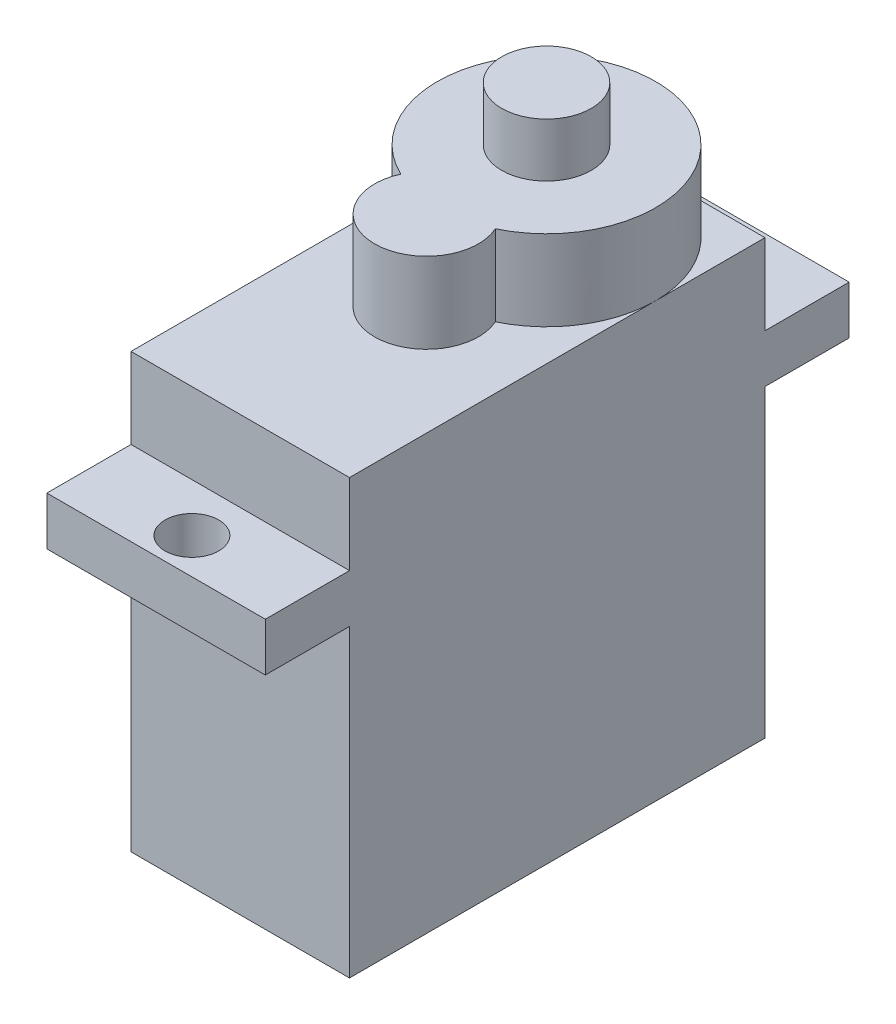
ISO-10303-21;
HEADER;
FILE_DESCRIPTION(('STEP AP214'),'2;1');
FILE_NAME('part.step','',(''),(''),'','','');
FILE_SCHEMA(('AUTOMOTIVE_DESIGN { 1 0 10303 214 1 1 1 1 }'));
ENDSEC;
DATA;
#1=APPLICATION_CONTEXT('core data for automotive mechanical design processes');
#2=APPLICATION_PROTOCOL_DEFINITION('international standard','automotive_design',2000,#1);
#3=PRODUCT_CONTEXT('',#1,'mechanical');
#4=PRODUCT('Part','Part','',(#3));
#5=PRODUCT_RELATED_PRODUCT_CATEGORY('part','',(#4));
#6=PRODUCT_DEFINITION_FORMATION('','',#4);
#7=PRODUCT_DEFINITION_CONTEXT('part definition',#1,'design');
#8=PRODUCT_DEFINITION('design','',#6,#7);
#9=PRODUCT_DEFINITION_SHAPE('','',#8);
#10=(LENGTH_UNIT() NAMED_UNIT(*) SI_UNIT(.MILLI.,.METRE.));
#11=(NAMED_UNIT(*) PLANE_ANGLE_UNIT() SI_UNIT($,.RADIAN.));
#12=(NAMED_UNIT(*) SI_UNIT($,.STERADIAN.) SOLID_ANGLE_UNIT());
#13=UNCERTAINTY_MEASURE_WITH_UNIT(LENGTH_MEASURE(1.E-05),#10,'distance_accuracy_value','');
#14=(GEOMETRIC_REPRESENTATION_CONTEXT(3) GLOBAL_UNCERTAINTY_ASSIGNED_CONTEXT((#13)) GLOBAL_UNIT_ASSIGNED_CONTEXT((#10,
#11,#12)) REPRESENTATION_CONTEXT('',''));
#15=CARTESIAN_POINT('',(0.,0.,0.));
#16=DIRECTION('',(0.,0.,1.));
#17=DIRECTION('',(1.,0.,0.));
#18=AXIS2_PLACEMENT_3D('',#15,#16,#17);
#19=CARTESIAN_POINT('',(0.,24.2,0.));
#20=DIRECTION('',(0.,-1.,0.));
#21=DIRECTION('',(0.,0.,-1.));
#22=AXIS2_PLACEMENT_3D('',#19,#20,#21);
#23=PLANE('',#22);
#24=CARTESIAN_POINT('',(0.,24.2,-5.5));
#25=DIRECTION('',(0.,1.,0.));
#26=DIRECTION('',(0.,0.,1.));
#27=AXIS2_PLACEMENT_3D('',#24,#25,#26);
#28=CIRCLE('',#27,6.1);
#29=CARTESIAN_POINT('',(2.63973642591585,24.2,-0.000746268656716051));
#30=VERTEX_POINT('',#29);
#31=CARTESIAN_POINT('',(6.09999999999999,24.2,-5.5));
#32=VERTEX_POINT('',#31);
#33=EDGE_CURVE('E282',#30,#32,#28,.T.);
#34=ORIENTED_EDGE('',*,*,#33,.F.);
#35=CARTESIAN_POINT('',(0.,24.2,1.2));
#36=DIRECTION('',(0.,1.,0.));
#37=DIRECTION('',(0.,0.,1.));
#38=AXIS2_PLACEMENT_3D('',#35,#36,#37);
#39=CIRCLE('',#38,2.9);
#40=CARTESIAN_POINT('',(-2.63973642591585,24.2,-0.000746268656716051));
#41=VERTEX_POINT('',#40);
#42=EDGE_CURVE('E62',#41,#30,#39,.T.);
#43=ORIENTED_EDGE('',*,*,#42,.F.);
#44=CARTESIAN_POINT('',(-6.1,24.2,-5.5));
#45=VERTEX_POINT('',#44);
#46=EDGE_CURVE('E66',#45,#41,#28,.T.);
#47=ORIENTED_EDGE('',*,*,#46,.F.);
#48=DIRECTION('',(0.,0.,1.));
#49=VECTOR('',#48,1.);
#50=CARTESIAN_POINT('',(-6.1,24.2,11.6));
#51=LINE('',#50,#49);
#52=CARTESIAN_POINT('',(-6.1,24.2,11.6));
#53=VERTEX_POINT('',#52);
#54=EDGE_CURVE('E247',#45,#53,#51,.T.);
#55=ORIENTED_EDGE('',*,*,#54,.T.);
#56=DIRECTION('',(1.,0.,0.));
#57=VECTOR('',#56,1.);
#58=CARTESIAN_POINT('',(-6.1,24.2,11.6));
#59=LINE('',#58,#57);
#60=CARTESIAN_POINT('',(6.09999999999999,24.2,11.6));
#61=VERTEX_POINT('',#60);
#62=EDGE_CURVE('E251',#53,#61,#59,.T.);
#63=ORIENTED_EDGE('',*,*,#62,.T.);
#64=DIRECTION('',(0.,0.,-1.));
#65=VECTOR('',#64,1.);
#66=CARTESIAN_POINT('',(6.09999999999999,24.2,11.6));
#67=LINE('',#66,#65);
#68=EDGE_CURVE('E239',#61,#32,#67,.T.);
#69=ORIENTED_EDGE('',*,*,#68,.T.);
#70=EDGE_LOOP('',(#34,#43,#47,#55,#63,#69));
#71=FACE_BOUND('',#70,.T.);
#72=ADVANCED_FACE('F45',(#71),#23,.F.);
#73=CARTESIAN_POINT('',(0.,24.2,-11.6));
#74=VERTEX_POINT('',#73);
#75=EDGE_CURVE('E54',#32,#74,#28,.T.);
#76=ORIENTED_EDGE('',*,*,#75,.F.);
#77=CARTESIAN_POINT('',(6.09999999999999,24.2,-11.6));
#78=VERTEX_POINT('',#77);
#79=EDGE_CURVE('E243',#32,#78,#67,.T.);
#80=ORIENTED_EDGE('',*,*,#79,.T.);
#81=DIRECTION('',(-1.,0.,0.));
#82=VECTOR('',#81,1.);
#83=CARTESIAN_POINT('',(-6.1,24.2,-11.6));
#84=LINE('',#83,#82);
#85=EDGE_CURVE('E244',#78,#74,#84,.T.);
#86=ORIENTED_EDGE('',*,*,#85,.T.);
#87=EDGE_LOOP('',(#76,#80,#86));
#88=FACE_BOUND('',#87,.T.);
#89=ADVANCED_FACE('F329',(#88),#23,.F.);
#90=CARTESIAN_POINT('',(-6.1,24.2,-11.6));
#91=DIRECTION('',(0.,0.,1.));
#92=DIRECTION('',(1.,0.,0.));
#93=AXIS2_PLACEMENT_3D('',#90,#91,#92);
#94=PLANE('',#93);
#95=DIRECTION('',(0.,-1.,0.));
#96=VECTOR('',#95,1.);
#97=CARTESIAN_POINT('',(6.09999999999999,24.2,-11.6));
#98=LINE('',#97,#96);
#99=CARTESIAN_POINT('',(6.09999999999999,19.7,-11.6));
#100=VERTEX_POINT('',#99);
#101=EDGE_CURVE('E275',#78,#100,#98,.T.);
#102=ORIENTED_EDGE('',*,*,#101,.T.);
#103=DIRECTION('',(-1.,0.,0.));
#104=VECTOR('',#103,1.);
#105=CARTESIAN_POINT('',(-6.09999999999999,19.7,-11.6));
#106=LINE('',#105,#104);
#107=CARTESIAN_POINT('',(-6.09999999999999,19.7,-11.6));
#108=VERTEX_POINT('',#107);
#109=EDGE_CURVE('E187',#100,#108,#106,.T.);
#110=ORIENTED_EDGE('',*,*,#109,.T.);
#111=DIRECTION('',(0.,-1.,0.));
#112=VECTOR('',#111,1.);
#113=CARTESIAN_POINT('',(-6.1,24.2,-11.6));
#114=LINE('',#113,#112);
#115=CARTESIAN_POINT('',(-6.1,24.2,-11.6));
#116=VERTEX_POINT('',#115);
#117=EDGE_CURVE('E272',#116,#108,#114,.T.);
#118=ORIENTED_EDGE('',*,*,#117,.F.);
#119=EDGE_CURVE('E242',#74,#116,#84,.T.);
#120=ORIENTED_EDGE('',*,*,#119,.F.);
#121=ORIENTED_EDGE('',*,*,#85,.F.);
#122=EDGE_LOOP('',(#102,#110,#118,#120,#121));
#123=FACE_BOUND('',#122,.T.);
#124=ADVANCED_FACE('F328',(#123),#94,.F.);
#125=CARTESIAN_POINT('',(-6.1,24.2,11.6));
#126=DIRECTION('',(0.,0.,-1.));
#127=DIRECTION('',(-1.,0.,0.));
#128=AXIS2_PLACEMENT_3D('',#125,#126,#127);
#129=PLANE('',#128);
#130=DIRECTION('',(1.,0.,0.));
#131=VECTOR('',#130,1.);
#132=CARTESIAN_POINT('',(-6.1,17.,11.6));
#133=LINE('',#132,#131);
#134=CARTESIAN_POINT('',(-6.1,17.,11.6));
#135=VERTEX_POINT('',#134);
#136=CARTESIAN_POINT('',(6.09999999999999,17.,11.6));
#137=VERTEX_POINT('',#136);
#138=EDGE_CURVE('E215',#135,#137,#133,.T.);
#139=ORIENTED_EDGE('',*,*,#138,.F.);
#140=DIRECTION('',(0.,-1.,0.));
#141=VECTOR('',#140,1.);
#142=CARTESIAN_POINT('',(-6.1,24.2,11.6));
#143=LINE('',#142,#141);
#144=CARTESIAN_POINT('',(-6.1,0.,11.6));
#145=VERTEX_POINT('',#144);
#146=EDGE_CURVE('E268',#135,#145,#143,.T.);
#147=ORIENTED_EDGE('',*,*,#146,.T.);
#148=DIRECTION('',(1.,0.,0.));
#149=VECTOR('',#148,1.);
#150=CARTESIAN_POINT('',(-6.1,0.,11.6));
#151=LINE('',#150,#149);
#152=CARTESIAN_POINT('',(6.09999999999999,0.,11.6));
#153=VERTEX_POINT('',#152);
#154=EDGE_CURVE('E262',#145,#153,#151,.T.);
#155=ORIENTED_EDGE('',*,*,#154,.T.);
#156=DIRECTION('',(0.,-1.,0.));
#157=VECTOR('',#156,1.);
#158=CARTESIAN_POINT('',(6.09999999999999,24.2,11.6));
#159=LINE('',#158,#157);
#160=EDGE_CURVE('E253',#137,#153,#159,.T.);
#161=ORIENTED_EDGE('',*,*,#160,.F.);
#162=EDGE_LOOP('',(#139,#147,#155,#161));
#163=FACE_BOUND('',#162,.T.);
#164=ADVANCED_FACE('F298',(#163),#129,.F.);
#165=DIRECTION('',(-1.,0.,0.));
#166=VECTOR('',#165,1.);
#167=CARTESIAN_POINT('',(-6.09999999999999,19.7,11.6));
#168=LINE('',#167,#166);
#169=CARTESIAN_POINT('',(6.09999999999999,19.7,11.6));
#170=VERTEX_POINT('',#169);
#171=CARTESIAN_POINT('',(-6.09999999999999,19.7,11.6));
#172=VERTEX_POINT('',#171);
#173=EDGE_CURVE('E222',#170,#172,#168,.T.);
#174=ORIENTED_EDGE('',*,*,#173,.F.);
#175=EDGE_CURVE('E265',#61,#170,#159,.T.);
#176=ORIENTED_EDGE('',*,*,#175,.F.);
#177=ORIENTED_EDGE('',*,*,#62,.F.);
#178=EDGE_CURVE('E269',#53,#172,#143,.T.);
#179=ORIENTED_EDGE('',*,*,#178,.T.);
#180=EDGE_LOOP('',(#174,#176,#177,#179));
#181=FACE_BOUND('',#180,.T.);
#182=ADVANCED_FACE('F352',(#181),#129,.F.);
#183=CARTESIAN_POINT('',(6.09999999999999,24.2,11.6));
#184=DIRECTION('',(-1.,0.,0.));
#185=DIRECTION('',(0.,0.,1.));
#186=AXIS2_PLACEMENT_3D('',#183,#184,#185);
#187=PLANE('',#186);
#188=DIRECTION('',(0.,0.,-1.));
#189=VECTOR('',#188,1.);
#190=CARTESIAN_POINT('',(6.09999999999999,0.,11.6));
#191=LINE('',#190,#189);
#192=CARTESIAN_POINT('',(6.09999999999999,0.,-11.6));
#193=VERTEX_POINT('',#192);
#194=EDGE_CURVE('E238',#153,#193,#191,.T.);
#195=ORIENTED_EDGE('',*,*,#194,.T.);
#196=CARTESIAN_POINT('',(6.09999999999999,17.,-11.6));
#197=VERTEX_POINT('',#196);
#198=EDGE_CURVE('E274',#197,#193,#98,.T.);
#199=ORIENTED_EDGE('',*,*,#198,.F.);
#200=DIRECTION('',(0.,0.,1.));
#201=VECTOR('',#200,1.);
#202=CARTESIAN_POINT('',(6.1,17.,-16.3));
#203=LINE('',#202,#201);
#204=CARTESIAN_POINT('',(6.1,17.,-16.3));
#205=VERTEX_POINT('',#204);
#206=EDGE_CURVE('E206',#205,#197,#203,.T.);
#207=ORIENTED_EDGE('',*,*,#206,.F.);
#208=DIRECTION('',(0.,1.,0.));
#209=VECTOR('',#208,1.);
#210=CARTESIAN_POINT('',(6.1,17.,-16.3));
#211=LINE('',#210,#209);
#212=CARTESIAN_POINT('',(6.09999999999999,19.7,-16.3));
#213=VERTEX_POINT('',#212);
#214=EDGE_CURVE('E183',#205,#213,#211,.T.);
#215=ORIENTED_EDGE('',*,*,#214,.T.);
#216=DIRECTION('',(0.,0.,1.));
#217=VECTOR('',#216,1.);
#218=CARTESIAN_POINT('',(6.09999999999999,19.7,-16.3));
#219=LINE('',#218,#217);
#220=EDGE_CURVE('E196',#213,#100,#219,.T.);
#221=ORIENTED_EDGE('',*,*,#220,.T.);
#222=ORIENTED_EDGE('',*,*,#101,.F.);
#223=ORIENTED_EDGE('',*,*,#79,.F.);
#224=ORIENTED_EDGE('',*,*,#68,.F.);
#225=ORIENTED_EDGE('',*,*,#175,.T.);
#226=DIRECTION('',(0.,0.,-1.));
#227=VECTOR('',#226,1.);
#228=CARTESIAN_POINT('',(6.09999999999999,19.7,16.3));
#229=LINE('',#228,#227);
#230=CARTESIAN_POINT('',(6.09999999999999,19.7,16.3));
#231=VERTEX_POINT('',#230);
#232=EDGE_CURVE('E235',#231,#170,#229,.T.);
#233=ORIENTED_EDGE('',*,*,#232,.F.);
#234=DIRECTION('',(0.,1.,0.));
#235=VECTOR('',#234,1.);
#236=CARTESIAN_POINT('',(6.1,17.,16.3));
#237=LINE('',#236,#235);
#238=CARTESIAN_POINT('',(6.1,17.,16.3));
#239=VERTEX_POINT('',#238);
#240=EDGE_CURVE('E211',#239,#231,#237,.T.);
#241=ORIENTED_EDGE('',*,*,#240,.F.);
#242=DIRECTION('',(0.,0.,-1.));
#243=VECTOR('',#242,1.);
#244=CARTESIAN_POINT('',(6.1,17.,16.3));
#245=LINE('',#244,#243);
#246=EDGE_CURVE('E221',#239,#137,#245,.T.);
#247=ORIENTED_EDGE('',*,*,#246,.T.);
#248=ORIENTED_EDGE('',*,*,#160,.T.);
#249=EDGE_LOOP('',(#195,#199,#207,#215,#221,#222,#223,#224,#225,#233,#241,#247,#248));
#250=FACE_BOUND('',#249,.T.);
#251=ADVANCED_FACE('F47',(#250),#187,.F.);
#252=CARTESIAN_POINT('',(-6.1,17.,-11.6));
#253=VERTEX_POINT('',#252);
#254=CARTESIAN_POINT('',(-6.1,0.,-11.6));
#255=VERTEX_POINT('',#254);
#256=EDGE_CURVE('E271',#253,#255,#114,.T.);
#257=ORIENTED_EDGE('',*,*,#256,.F.);
#258=DIRECTION('',(1.,0.,0.));
#259=VECTOR('',#258,1.);
#260=CARTESIAN_POINT('',(-6.1,17.,-11.6));
#261=LINE('',#260,#259);
#262=EDGE_CURVE('E182',#253,#197,#261,.T.);
#263=ORIENTED_EDGE('',*,*,#262,.T.);
#264=ORIENTED_EDGE('',*,*,#198,.T.);
#265=DIRECTION('',(-1.,0.,0.));
#266=VECTOR('',#265,1.);
#267=CARTESIAN_POINT('',(-6.1,0.,-11.6));
#268=LINE('',#267,#266);
#269=EDGE_CURVE('E256',#193,#255,#268,.T.);
#270=ORIENTED_EDGE('',*,*,#269,.T.);
#271=EDGE_LOOP('',(#257,#263,#264,#270));
#272=FACE_BOUND('',#271,.T.);
#273=ADVANCED_FACE('F287',(#272),#94,.F.);
#274=CARTESIAN_POINT('',(-6.1,24.2,11.6));
#275=DIRECTION('',(1.,0.,0.));
#276=DIRECTION('',(0.,0.,-1.));
#277=AXIS2_PLACEMENT_3D('',#274,#275,#276);
#278=PLANE('',#277);
#279=DIRECTION('',(0.,0.,1.));
#280=VECTOR('',#279,1.);
#281=CARTESIAN_POINT('',(-6.1,0.,11.6));
#282=LINE('',#281,#280);
#283=EDGE_CURVE('E259',#255,#145,#282,.T.);
#284=ORIENTED_EDGE('',*,*,#283,.T.);
#285=ORIENTED_EDGE('',*,*,#146,.F.);
#286=DIRECTION('',(0.,0.,-1.));
#287=VECTOR('',#286,1.);
#288=CARTESIAN_POINT('',(-6.1,17.,16.3));
#289=LINE('',#288,#287);
#290=CARTESIAN_POINT('',(-6.1,17.,16.3));
#291=VERTEX_POINT('',#290);
#292=EDGE_CURVE('E229',#291,#135,#289,.T.);
#293=ORIENTED_EDGE('',*,*,#292,.F.);
#294=DIRECTION('',(0.,-1.,0.));
#295=VECTOR('',#294,1.);
#296=CARTESIAN_POINT('',(-6.09999999999999,19.7,16.3));
#297=LINE('',#296,#295);
#298=CARTESIAN_POINT('',(-6.09999999999999,19.7,16.3));
#299=VERTEX_POINT('',#298);
#300=EDGE_CURVE('E217',#299,#291,#297,.T.);
#301=ORIENTED_EDGE('',*,*,#300,.F.);
#302=DIRECTION('',(0.,0.,-1.));
#303=VECTOR('',#302,1.);
#304=CARTESIAN_POINT('',(-6.09999999999999,19.7,16.3));
#305=LINE('',#304,#303);
#306=EDGE_CURVE('E232',#299,#172,#305,.T.);
#307=ORIENTED_EDGE('',*,*,#306,.T.);
#308=ORIENTED_EDGE('',*,*,#178,.F.);
#309=ORIENTED_EDGE('',*,*,#54,.F.);
#310=EDGE_CURVE('E248',#116,#45,#51,.T.);
#311=ORIENTED_EDGE('',*,*,#310,.F.);
#312=ORIENTED_EDGE('',*,*,#117,.T.);
#313=DIRECTION('',(0.,0.,1.));
#314=VECTOR('',#313,1.);
#315=CARTESIAN_POINT('',(-6.09999999999999,19.7,-16.3));
#316=LINE('',#315,#314);
#317=CARTESIAN_POINT('',(-6.09999999999999,19.7,-16.3));
#318=VERTEX_POINT('',#317);
#319=EDGE_CURVE('E202',#318,#108,#316,.T.);
#320=ORIENTED_EDGE('',*,*,#319,.F.);
#321=DIRECTION('',(0.,-1.,0.));
#322=VECTOR('',#321,1.);
#323=CARTESIAN_POINT('',(-6.09999999999999,19.7,-16.3));
#324=LINE('',#323,#322);
#325=CARTESIAN_POINT('',(-6.1,17.,-16.3));
#326=VERTEX_POINT('',#325);
#327=EDGE_CURVE('E190',#318,#326,#324,.T.);
#328=ORIENTED_EDGE('',*,*,#327,.T.);
#329=DIRECTION('',(0.,0.,1.));
#330=VECTOR('',#329,1.);
#331=CARTESIAN_POINT('',(-6.1,17.,-16.3));
#332=LINE('',#331,#330);
#333=EDGE_CURVE('E204',#326,#253,#332,.T.);
#334=ORIENTED_EDGE('',*,*,#333,.T.);
#335=ORIENTED_EDGE('',*,*,#256,.T.);
#336=EDGE_LOOP('',(#284,#285,#293,#301,#307,#308,#309,#311,#312,#320,#328,#334,#335));
#337=FACE_BOUND('',#336,.T.);
#338=ADVANCED_FACE('F302',(#337),#278,.F.);
#339=EDGE_CURVE('E280',#74,#45,#28,.T.);
#340=ORIENTED_EDGE('',*,*,#339,.F.);
#341=ORIENTED_EDGE('',*,*,#119,.T.);
#342=ORIENTED_EDGE('',*,*,#310,.T.);
#343=EDGE_LOOP('',(#340,#341,#342));
#344=FACE_BOUND('',#343,.T.);
#345=ADVANCED_FACE('F325',(#344),#23,.F.);
#346=CARTESIAN_POINT('',(0.,0.,0.));
#347=DIRECTION('',(0.,-1.,0.));
#348=DIRECTION('',(0.,0.,-1.));
#349=AXIS2_PLACEMENT_3D('',#346,#347,#348);
#350=PLANE('',#349);
#351=ORIENTED_EDGE('',*,*,#194,.F.);
#352=ORIENTED_EDGE('',*,*,#154,.F.);
#353=ORIENTED_EDGE('',*,*,#283,.F.);
#354=ORIENTED_EDGE('',*,*,#269,.F.);
#355=EDGE_LOOP('',(#351,#352,#353,#354));
#356=FACE_BOUND('',#355,.T.);
#357=ADVANCED_FACE('F293',(#356),#350,.T.);
#358=CARTESIAN_POINT('',(-6.09999999999999,19.7,16.3));
#359=DIRECTION('',(0.,-1.,0.));
#360=DIRECTION('',(0.,0.,-1.));
#361=AXIS2_PLACEMENT_3D('',#358,#359,#360);
#362=PLANE('',#361);
#363=CARTESIAN_POINT('',(0.,19.7,14.3));
#364=DIRECTION('',(0.,1.,0.));
#365=DIRECTION('',(0.,0.,1.));
#366=AXIS2_PLACEMENT_3D('',#363,#364,#365);
#367=CIRCLE('',#366,1.5);
#368=CARTESIAN_POINT('',(0.,19.7,15.8));
#369=VERTEX_POINT('',#368);
#370=EDGE_CURVE('E208',#369,#369,#367,.T.);
#371=ORIENTED_EDGE('',*,*,#370,.F.);
#372=EDGE_LOOP('',(#371));
#373=FACE_BOUND('',#372,.T.);
#374=ORIENTED_EDGE('',*,*,#173,.T.);
#375=ORIENTED_EDGE('',*,*,#306,.F.);
#376=DIRECTION('',(-1.,0.,0.));
#377=VECTOR('',#376,1.);
#378=CARTESIAN_POINT('',(-6.09999999999999,19.7,16.3));
#379=LINE('',#378,#377);
#380=EDGE_CURVE('E214',#231,#299,#379,.T.);
#381=ORIENTED_EDGE('',*,*,#380,.F.);
#382=ORIENTED_EDGE('',*,*,#232,.T.);
#383=EDGE_LOOP('',(#374,#375,#381,#382));
#384=FACE_BOUND('',#383,.T.);
#385=ADVANCED_FACE('F344',(#373,#384),#362,.F.);
#386=CARTESIAN_POINT('',(-6.1,17.,16.3));
#387=DIRECTION('',(0.,1.,0.));
#388=DIRECTION('',(0.,0.,1.));
#389=AXIS2_PLACEMENT_3D('',#386,#387,#388);
#390=PLANE('',#389);
#391=CARTESIAN_POINT('',(0.,17.,14.3));
#392=DIRECTION('',(0.,1.,0.));
#393=DIRECTION('',(0.,0.,1.));
#394=AXIS2_PLACEMENT_3D('',#391,#392,#393);
#395=CIRCLE('',#394,1.5);
#396=CARTESIAN_POINT('',(0.,17.,15.8));
#397=VERTEX_POINT('',#396);
#398=EDGE_CURVE('E49',#397,#397,#395,.T.);
#399=ORIENTED_EDGE('',*,*,#398,.T.);
#400=EDGE_LOOP('',(#399));
#401=FACE_BOUND('',#400,.T.);
#402=ORIENTED_EDGE('',*,*,#138,.T.);
#403=ORIENTED_EDGE('',*,*,#246,.F.);
#404=DIRECTION('',(1.,0.,0.));
#405=VECTOR('',#404,1.);
#406=CARTESIAN_POINT('',(-6.1,17.,16.3));
#407=LINE('',#406,#405);
#408=EDGE_CURVE('E219',#291,#239,#407,.T.);
#409=ORIENTED_EDGE('',*,*,#408,.F.);
#410=ORIENTED_EDGE('',*,*,#292,.T.);
#411=EDGE_LOOP('',(#402,#403,#409,#410));
#412=FACE_BOUND('',#411,.T.);
#413=ADVANCED_FACE('F369',(#401,#412),#390,.F.);
#414=CARTESIAN_POINT('',(0.,0.,16.3));
#415=DIRECTION('',(0.,0.,-1.));
#416=DIRECTION('',(-1.,0.,0.));
#417=AXIS2_PLACEMENT_3D('',#414,#415,#416);
#418=PLANE('',#417);
#419=ORIENTED_EDGE('',*,*,#240,.T.);
#420=ORIENTED_EDGE('',*,*,#380,.T.);
#421=ORIENTED_EDGE('',*,*,#300,.T.);
#422=ORIENTED_EDGE('',*,*,#408,.T.);
#423=EDGE_LOOP('',(#419,#420,#421,#422));
#424=FACE_BOUND('',#423,.T.);
#425=ADVANCED_FACE('F366',(#424),#418,.F.);
#426=CARTESIAN_POINT('',(0.,0.,14.3));
#427=DIRECTION('',(0.,1.,0.));
#428=DIRECTION('',(0.,0.,1.));
#429=AXIS2_PLACEMENT_3D('',#426,#427,#428);
#430=CYLINDRICAL_SURFACE('',#429,1.5);
#431=ORIENTED_EDGE('',*,*,#370,.T.);
#432=EDGE_LOOP('',(#431));
#433=FACE_BOUND('',#432,.T.);
#434=ORIENTED_EDGE('',*,*,#398,.F.);
#435=EDGE_LOOP('',(#434));
#436=FACE_BOUND('',#435,.T.);
#437=ADVANCED_FACE('F377',(#433,#436),#430,.F.);
#438=CARTESIAN_POINT('',(-6.1,17.,-16.3));
#439=DIRECTION('',(0.,-1.,0.));
#440=DIRECTION('',(0.,0.,-1.));
#441=AXIS2_PLACEMENT_3D('',#438,#439,#440);
#442=PLANE('',#441);
#443=CARTESIAN_POINT('',(0.,17.,-14.3));
#444=DIRECTION('',(0.,-1.,0.));
#445=DIRECTION('',(0.,0.,-1.));
#446=AXIS2_PLACEMENT_3D('',#443,#444,#445);
#447=CIRCLE('',#446,1.5);
#448=CARTESIAN_POINT('',(0.,17.,-15.8));
#449=VERTEX_POINT('',#448);
#450=EDGE_CURVE('E175',#449,#449,#447,.F.);
#451=ORIENTED_EDGE('',*,*,#450,.T.);
#452=EDGE_LOOP('',(#451));
#453=FACE_BOUND('',#452,.T.);
#454=ORIENTED_EDGE('',*,*,#262,.F.);
#455=ORIENTED_EDGE('',*,*,#333,.F.);
#456=DIRECTION('',(1.,0.,0.));
#457=VECTOR('',#456,1.);
#458=CARTESIAN_POINT('',(-6.1,17.,-16.3));
#459=LINE('',#458,#457);
#460=EDGE_CURVE('E186',#326,#205,#459,.T.);
#461=ORIENTED_EDGE('',*,*,#460,.T.);
#462=ORIENTED_EDGE('',*,*,#206,.T.);
#463=EDGE_LOOP('',(#454,#455,#461,#462));
#464=FACE_BOUND('',#463,.T.);
#465=ADVANCED_FACE('F306',(#453,#464),#442,.T.);
#466=CARTESIAN_POINT('',(-6.09999999999999,19.7,-16.3));
#467=DIRECTION('',(0.,1.,0.));
#468=DIRECTION('',(0.,0.,1.));
#469=AXIS2_PLACEMENT_3D('',#466,#467,#468);
#470=PLANE('',#469);
#471=CARTESIAN_POINT('',(0.,19.7,-14.3));
#472=DIRECTION('',(0.,-1.,0.));
#473=DIRECTION('',(0.,0.,-1.));
#474=AXIS2_PLACEMENT_3D('',#471,#472,#473);
#475=CIRCLE('',#474,1.5);
#476=CARTESIAN_POINT('',(0.,19.7,-15.8));
#477=VERTEX_POINT('',#476);
#478=EDGE_CURVE('E172',#477,#477,#475,.T.);
#479=ORIENTED_EDGE('',*,*,#478,.T.);
#480=EDGE_LOOP('',(#479));
#481=FACE_BOUND('',#480,.T.);
#482=ORIENTED_EDGE('',*,*,#109,.F.);
#483=ORIENTED_EDGE('',*,*,#220,.F.);
#484=DIRECTION('',(-1.,0.,0.));
#485=VECTOR('',#484,1.);
#486=CARTESIAN_POINT('',(-6.09999999999999,19.7,-16.3));
#487=LINE('',#486,#485);
#488=EDGE_CURVE('E193',#213,#318,#487,.T.);
#489=ORIENTED_EDGE('',*,*,#488,.T.);
#490=ORIENTED_EDGE('',*,*,#319,.T.);
#491=EDGE_LOOP('',(#482,#483,#489,#490));
#492=FACE_BOUND('',#491,.T.);
#493=ADVANCED_FACE('F313',(#481,#492),#470,.T.);
#494=CARTESIAN_POINT('',(0.,0.,-16.3));
#495=DIRECTION('',(0.,0.,1.));
#496=DIRECTION('',(-1.,0.,0.));
#497=AXIS2_PLACEMENT_3D('',#494,#495,#496);
#498=PLANE('',#497);
#499=ORIENTED_EDGE('',*,*,#214,.F.);
#500=ORIENTED_EDGE('',*,*,#460,.F.);
#501=ORIENTED_EDGE('',*,*,#327,.F.);
#502=ORIENTED_EDGE('',*,*,#488,.F.);
#503=EDGE_LOOP('',(#499,#500,#501,#502));
#504=FACE_BOUND('',#503,.T.);
#505=ADVANCED_FACE('F310',(#504),#498,.F.);
#506=CARTESIAN_POINT('',(0.,0.,-14.3));
#507=DIRECTION('',(0.,1.,0.));
#508=DIRECTION('',(0.,0.,1.));
#509=AXIS2_PLACEMENT_3D('',#506,#507,#508);
#510=CYLINDRICAL_SURFACE('',#509,1.5);
#511=ORIENTED_EDGE('',*,*,#450,.F.);
#512=EDGE_LOOP('',(#511));
#513=FACE_BOUND('',#512,.T.);
#514=ORIENTED_EDGE('',*,*,#478,.F.);
#515=EDGE_LOOP('',(#514));
#516=FACE_BOUND('',#515,.T.);
#517=ADVANCED_FACE('F392',(#513,#516),#510,.F.);
#518=CARTESIAN_POINT('',(0.,28.7,-5.5));
#519=DIRECTION('',(0.,-1.,0.));
#520=DIRECTION('',(0.,0.,-1.));
#521=AXIS2_PLACEMENT_3D('',#518,#519,#520);
#522=CYLINDRICAL_SURFACE('',#521,6.1);
#523=ORIENTED_EDGE('',*,*,#33,.T.);
#524=ORIENTED_EDGE('',*,*,#75,.T.);
#525=ORIENTED_EDGE('',*,*,#339,.T.);
#526=ORIENTED_EDGE('',*,*,#46,.T.);
#527=DIRECTION('',(0.,-1.,0.));
#528=VECTOR('',#527,1.);
#529=CARTESIAN_POINT('',(-2.63973642591585,28.7,-0.000746268656716051));
#530=LINE('',#529,#528);
#531=CARTESIAN_POINT('',(-2.63973642591585,28.7,-0.000746268656716051));
#532=VERTEX_POINT('',#531);
#533=EDGE_CURVE('E159',#532,#41,#530,.T.);
#534=ORIENTED_EDGE('',*,*,#533,.F.);
#535=CARTESIAN_POINT('',(0.,28.7,-5.5));
#536=DIRECTION('',(0.,1.,0.));
#537=DIRECTION('',(0.,0.,1.));
#538=AXIS2_PLACEMENT_3D('',#535,#536,#537);
#539=CIRCLE('',#538,6.1);
#540=CARTESIAN_POINT('',(2.63973642591585,28.7,-0.000746268656716051));
#541=VERTEX_POINT('',#540);
#542=EDGE_CURVE('E164',#541,#532,#539,.T.);
#543=ORIENTED_EDGE('',*,*,#542,.F.);
#544=DIRECTION('',(0.,-1.,0.));
#545=VECTOR('',#544,1.);
#546=CARTESIAN_POINT('',(2.63973642591585,28.7,-0.000746268656716051));
#547=LINE('',#546,#545);
#548=EDGE_CURVE('E161',#541,#30,#547,.T.);
#549=ORIENTED_EDGE('',*,*,#548,.T.);
#550=EDGE_LOOP('',(#523,#524,#525,#526,#534,#543,#549));
#551=FACE_BOUND('',#550,.T.);
#552=ADVANCED_FACE('F170',(#551),#522,.T.);
#553=CARTESIAN_POINT('',(0.,28.7,1.2));
#554=DIRECTION('',(0.,-1.,0.));
#555=DIRECTION('',(0.,0.,-1.));
#556=AXIS2_PLACEMENT_3D('',#553,#554,#555);
#557=CYLINDRICAL_SURFACE('',#556,2.9);
#558=ORIENTED_EDGE('',*,*,#42,.T.);
#559=ORIENTED_EDGE('',*,*,#548,.F.);
#560=CARTESIAN_POINT('',(0.,28.7,1.2));
#561=DIRECTION('',(0.,1.,0.));
#562=DIRECTION('',(0.,0.,1.));
#563=AXIS2_PLACEMENT_3D('',#560,#561,#562);
#564=CIRCLE('',#563,2.9);
#565=EDGE_CURVE('E155',#532,#541,#564,.T.);
#566=ORIENTED_EDGE('',*,*,#565,.F.);
#567=ORIENTED_EDGE('',*,*,#533,.T.);
#568=EDGE_LOOP('',(#558,#559,#566,#567));
#569=FACE_BOUND('',#568,.T.);
#570=ADVANCED_FACE('F157',(#569),#557,.T.);
#571=CARTESIAN_POINT('',(0.,28.7,0.));
#572=DIRECTION('',(0.,1.,0.));
#573=DIRECTION('',(0.,0.,1.));
#574=AXIS2_PLACEMENT_3D('',#571,#572,#573);
#575=PLANE('',#574);
#576=CARTESIAN_POINT('',(0.,28.7,-5.5));
#577=DIRECTION('',(0.,1.,0.));
#578=DIRECTION('',(0.,0.,1.));
#579=AXIS2_PLACEMENT_3D('',#576,#577,#578);
#580=CIRCLE('',#579,2.5);
#581=CARTESIAN_POINT('',(0.,28.7,-3.));
#582=VERTEX_POINT('',#581);
#583=EDGE_CURVE('E11',#582,#582,#580,.T.);
#584=ORIENTED_EDGE('',*,*,#583,.F.);
#585=EDGE_LOOP('',(#584));
#586=FACE_BOUND('',#585,.T.);
#587=ORIENTED_EDGE('',*,*,#542,.T.);
#588=ORIENTED_EDGE('',*,*,#565,.T.);
#589=EDGE_LOOP('',(#587,#588));
#590=FACE_BOUND('',#589,.T.);
#591=ADVANCED_FACE('F166',(#586,#590),#575,.T.);
#592=CARTESIAN_POINT('',(0.,31.7,-5.5));
#593=DIRECTION('',(0.,-1.,0.));
#594=DIRECTION('',(0.,0.,-1.));
#595=AXIS2_PLACEMENT_3D('',#592,#593,#594);
#596=CYLINDRICAL_SURFACE('',#595,2.5);
#597=CARTESIAN_POINT('',(0.,31.7,-5.5));
#598=DIRECTION('',(0.,1.,0.));
#599=DIRECTION('',(0.,0.,1.));
#600=AXIS2_PLACEMENT_3D('',#597,#598,#599);
#601=CIRCLE('',#600,2.5);
#602=CARTESIAN_POINT('',(0.,31.7,-3.));
#603=VERTEX_POINT('',#602);
#604=EDGE_CURVE('E320',#603,#603,#601,.T.);
#605=ORIENTED_EDGE('',*,*,#604,.F.);
#606=EDGE_LOOP('',(#605));
#607=FACE_BOUND('',#606,.T.);
#608=ORIENTED_EDGE('',*,*,#583,.T.);
#609=EDGE_LOOP('',(#608));
#610=FACE_BOUND('',#609,.T.);
#611=ADVANCED_FACE('F401',(#607,#610),#596,.T.);
#612=CARTESIAN_POINT('',(0.,31.7,-5.5));
#613=DIRECTION('',(0.,1.,0.));
#614=DIRECTION('',(0.,0.,1.));
#615=AXIS2_PLACEMENT_3D('',#612,#613,#614);
#616=PLANE('',#615);
#617=ORIENTED_EDGE('',*,*,#604,.T.);
#618=EDGE_LOOP('',(#617));
#619=FACE_BOUND('',#618,.T.);
#620=ADVANCED_FACE('F405',(#619),#616,.T.);
#621=CLOSED_SHELL('',(#72,#89,#124,#164,#182,#251,#273,#338,#345,#357,#385,#413,#425,#437,#465,
#493,#505,#517,#552,#570,#591,#611,#620));
#622=MANIFOLD_SOLID_BREP('B2',#621);
#623=ADVANCED_BREP_SHAPE_REPRESENTATION('',(#18,#622),#14);
#624=SHAPE_DEFINITION_REPRESENTATION(#9,#623);
ENDSEC;
END-ISO-10303-21;
